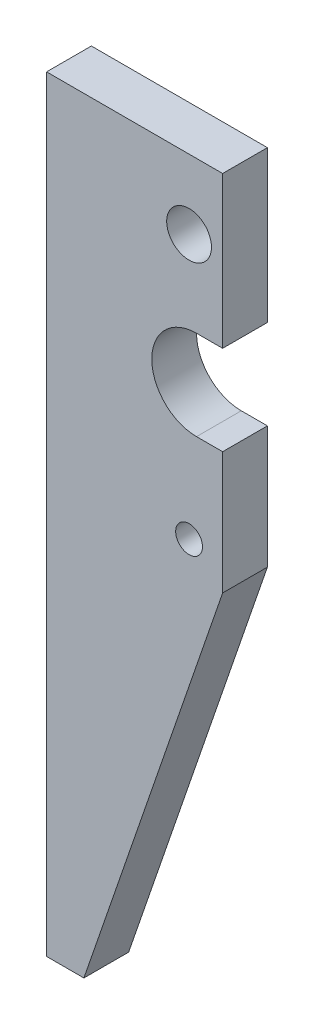
ISO-10303-21;
HEADER;
FILE_DESCRIPTION(('STEP AP214'),'2;1');
FILE_NAME('part.step','',(''),(''),'','','');
FILE_SCHEMA(('AUTOMOTIVE_DESIGN { 1 0 10303 214 1 1 1 1 }'));
ENDSEC;
DATA;
#1=APPLICATION_CONTEXT('core data for automotive mechanical design processes');
#2=APPLICATION_PROTOCOL_DEFINITION('international standard','automotive_design',2000,#1);
#3=PRODUCT_CONTEXT('',#1,'mechanical');
#4=PRODUCT('Part','Part','',(#3));
#5=PRODUCT_RELATED_PRODUCT_CATEGORY('part','',(#4));
#6=PRODUCT_DEFINITION_FORMATION('','',#4);
#7=PRODUCT_DEFINITION_CONTEXT('part definition',#1,'design');
#8=PRODUCT_DEFINITION('design','',#6,#7);
#9=PRODUCT_DEFINITION_SHAPE('','',#8);
#10=(LENGTH_UNIT() NAMED_UNIT(*) SI_UNIT(.MILLI.,.METRE.));
#11=(NAMED_UNIT(*) PLANE_ANGLE_UNIT() SI_UNIT($,.RADIAN.));
#12=(NAMED_UNIT(*) SI_UNIT($,.STERADIAN.) SOLID_ANGLE_UNIT());
#13=UNCERTAINTY_MEASURE_WITH_UNIT(LENGTH_MEASURE(1.E-05),#10,'distance_accuracy_value','');
#14=(GEOMETRIC_REPRESENTATION_CONTEXT(3) GLOBAL_UNCERTAINTY_ASSIGNED_CONTEXT((#13)) GLOBAL_UNIT_ASSIGNED_CONTEXT((#10,
#11,#12)) REPRESENTATION_CONTEXT('',''));
#15=CARTESIAN_POINT('',(0.,0.,0.));
#16=DIRECTION('',(0.,0.,1.));
#17=DIRECTION('',(1.,0.,0.));
#18=AXIS2_PLACEMENT_3D('',#15,#16,#17);
#19=CARTESIAN_POINT('',(53.673673192506,82.0713293790412,6.));
#20=DIRECTION('',(0.,0.,1.));
#21=DIRECTION('',(1.,0.,0.));
#22=AXIS2_PLACEMENT_3D('',#19,#20,#21);
#23=PLANE('',#22);
#24=CARTESIAN_POINT('',(52.6736731925056,63.6713293790409,6.));
#25=DIRECTION('',(0.,0.,1.));
#26=DIRECTION('',(1.,0.,0.));
#27=AXIS2_PLACEMENT_3D('',#24,#25,#26);
#28=CIRCLE('',#27,1.80000000000021);
#29=CARTESIAN_POINT('',(54.4736731925058,63.6713293790409,6.));
#30=VERTEX_POINT('',#29);
#31=EDGE_CURVE('E145',#30,#30,#28,.T.);
#32=ORIENTED_EDGE('',*,*,#31,.F.);
#33=EDGE_LOOP('',(#32));
#34=FACE_BOUND('',#33,.T.);
#35=CARTESIAN_POINT('',(53.673673192506,82.0713293790412,6.));
#36=DIRECTION('',(0.,0.,-1.));
#37=DIRECTION('',(1.,0.,0.));
#38=AXIS2_PLACEMENT_3D('',#35,#36,#37);
#39=CIRCLE('',#38,6.0000000000002);
#40=CARTESIAN_POINT('',(53.673673192506,76.071329379041,6.));
#41=VERTEX_POINT('',#40);
#42=CARTESIAN_POINT('',(53.6736731925061,88.0713293790414,6.));
#43=VERTEX_POINT('',#42);
#44=EDGE_CURVE('E158',#41,#43,#39,.T.);
#45=ORIENTED_EDGE('',*,*,#44,.T.);
#46=DIRECTION('',(1.,1.34812795847367E-13,0.));
#47=VECTOR('',#46,1.);
#48=CARTESIAN_POINT('',(53.6736731925061,88.0713293790414,6.));
#49=LINE('',#48,#47);
#50=CARTESIAN_POINT('',(57.1736731925054,88.0713293790419,6.));
#51=VERTEX_POINT('',#50);
#52=EDGE_CURVE('E101',#43,#51,#49,.T.);
#53=ORIENTED_EDGE('',*,*,#52,.T.);
#54=DIRECTION('',(0.,1.,0.));
#55=VECTOR('',#54,1.);
#56=CARTESIAN_POINT('',(57.1736731925057,108.36959926016,6.));
#57=LINE('',#56,#55);
#58=CARTESIAN_POINT('',(57.1736731925057,108.36959926016,6.));
#59=VERTEX_POINT('',#58);
#60=EDGE_CURVE('E176',#51,#59,#57,.T.);
#61=ORIENTED_EDGE('',*,*,#60,.T.);
#62=DIRECTION('',(-1.,0.,0.));
#63=VECTOR('',#62,1.);
#64=CARTESIAN_POINT('',(57.1736731925057,108.36959926016,6.));
#65=LINE('',#64,#63);
#66=CARTESIAN_POINT('',(33.5736731925061,108.369599260161,6.));
#67=VERTEX_POINT('',#66);
#68=EDGE_CURVE('E193',#59,#67,#65,.T.);
#69=ORIENTED_EDGE('',*,*,#68,.T.);
#70=DIRECTION('',(0.,-1.,0.));
#71=VECTOR('',#70,1.);
#72=CARTESIAN_POINT('',(33.5736731925061,108.369599260161,6.));
#73=LINE('',#72,#71);
#74=CARTESIAN_POINT('',(33.5736731925061,5.67132937904107,6.));
#75=VERTEX_POINT('',#74);
#76=EDGE_CURVE('E192',#67,#75,#73,.T.);
#77=ORIENTED_EDGE('',*,*,#76,.T.);
#78=DIRECTION('',(1.,-1.07899800205757E-13,0.));
#79=VECTOR('',#78,1.);
#80=CARTESIAN_POINT('',(33.5736731925061,5.67132937904107,6.));
#81=LINE('',#80,#79);
#82=CARTESIAN_POINT('',(38.5736731925061,5.67132937904053,6.));
#83=VERTEX_POINT('',#82);
#84=EDGE_CURVE('E123',#75,#83,#81,.T.);
#85=ORIENTED_EDGE('',*,*,#84,.T.);
#86=DIRECTION('',(0.325666906351415,0.945484566826714,0.));
#87=VECTOR('',#86,1.);
#88=CARTESIAN_POINT('',(38.5736731925061,5.67132937904053,6.));
#89=LINE('',#88,#87);
#90=CARTESIAN_POINT('',(57.1736731925057,59.6713293790409,6.));
#91=VERTEX_POINT('',#90);
#92=EDGE_CURVE('E117',#83,#91,#89,.T.);
#93=ORIENTED_EDGE('',*,*,#92,.T.);
#94=DIRECTION('',(0.,1.,0.));
#95=VECTOR('',#94,1.);
#96=CARTESIAN_POINT('',(57.173673192505,76.0713293790407,6.));
#97=LINE('',#96,#95);
#98=CARTESIAN_POINT('',(57.173673192505,76.0713293790407,6.));
#99=VERTEX_POINT('',#98);
#100=EDGE_CURVE('E121',#91,#99,#97,.T.);
#101=ORIENTED_EDGE('',*,*,#100,.T.);
#102=DIRECTION('',(-1.,1.03092138000934E-13,0.));
#103=VECTOR('',#102,1.);
#104=CARTESIAN_POINT('',(53.673673192506,76.071329379041,6.));
#105=LINE('',#104,#103);
#106=EDGE_CURVE('E55',#99,#41,#105,.T.);
#107=ORIENTED_EDGE('',*,*,#106,.T.);
#108=EDGE_LOOP('',(#45,#53,#61,#69,#77,#85,#93,#101,#107));
#109=FACE_BOUND('',#108,.T.);
#110=CARTESIAN_POINT('',(52.6736731925056,99.0589307778287,6.));
#111=DIRECTION('',(0.,0.,1.));
#112=DIRECTION('',(1.,0.,0.));
#113=AXIS2_PLACEMENT_3D('',#110,#111,#112);
#114=CIRCLE('',#113,3.);
#115=CARTESIAN_POINT('',(55.6736731925056,99.0589307778287,6.));
#116=VERTEX_POINT('',#115);
#117=EDGE_CURVE('E203',#116,#116,#114,.T.);
#118=ORIENTED_EDGE('',*,*,#117,.F.);
#119=EDGE_LOOP('',(#118));
#120=FACE_BOUND('',#119,.T.);
#121=ADVANCED_FACE('F38',(#34,#109,#120),#23,.T.);
#122=CARTESIAN_POINT('',(53.673673192506,82.0713293790412,0.));
#123=DIRECTION('',(0.,0.,1.));
#124=DIRECTION('',(1.,0.,0.));
#125=AXIS2_PLACEMENT_3D('',#122,#123,#124);
#126=PLANE('',#125);
#127=CARTESIAN_POINT('',(53.673673192506,82.0713293790412,0.));
#128=DIRECTION('',(0.,0.,-1.));
#129=DIRECTION('',(1.,0.,0.));
#130=AXIS2_PLACEMENT_3D('',#127,#128,#129);
#131=CIRCLE('',#130,6.0000000000002);
#132=CARTESIAN_POINT('',(53.673673192506,76.071329379041,0.));
#133=VERTEX_POINT('',#132);
#134=CARTESIAN_POINT('',(53.6736731925061,88.0713293790414,0.));
#135=VERTEX_POINT('',#134);
#136=EDGE_CURVE('E141',#133,#135,#131,.T.);
#137=ORIENTED_EDGE('',*,*,#136,.F.);
#138=DIRECTION('',(-1.,1.03092138000934E-13,0.));
#139=VECTOR('',#138,1.);
#140=CARTESIAN_POINT('',(53.673673192506,76.071329379041,0.));
#141=LINE('',#140,#139);
#142=CARTESIAN_POINT('',(57.173673192505,76.0713293790407,0.));
#143=VERTEX_POINT('',#142);
#144=EDGE_CURVE('E93',#143,#133,#141,.T.);
#145=ORIENTED_EDGE('',*,*,#144,.F.);
#146=DIRECTION('',(0.,1.,0.));
#147=VECTOR('',#146,1.);
#148=CARTESIAN_POINT('',(57.173673192505,76.0713293790407,0.));
#149=LINE('',#148,#147);
#150=CARTESIAN_POINT('',(57.1736731925057,59.6713293790409,0.));
#151=VERTEX_POINT('',#150);
#152=EDGE_CURVE('E87',#151,#143,#149,.T.);
#153=ORIENTED_EDGE('',*,*,#152,.F.);
#154=DIRECTION('',(0.325666906351415,0.945484566826714,0.));
#155=VECTOR('',#154,1.);
#156=CARTESIAN_POINT('',(38.5736731925061,5.67132937904053,0.));
#157=LINE('',#156,#155);
#158=CARTESIAN_POINT('',(38.5736731925061,5.67132937904053,0.));
#159=VERTEX_POINT('',#158);
#160=EDGE_CURVE('E131',#159,#151,#157,.T.);
#161=ORIENTED_EDGE('',*,*,#160,.F.);
#162=DIRECTION('',(1.,-1.07899800205757E-13,0.));
#163=VECTOR('',#162,1.);
#164=CARTESIAN_POINT('',(33.5736731925061,5.67132937904107,0.));
#165=LINE('',#164,#163);
#166=CARTESIAN_POINT('',(33.5736731925061,5.67132937904107,0.));
#167=VERTEX_POINT('',#166);
#168=EDGE_CURVE('E153',#167,#159,#165,.T.);
#169=ORIENTED_EDGE('',*,*,#168,.F.);
#170=DIRECTION('',(0.,-1.,0.));
#171=VECTOR('',#170,1.);
#172=CARTESIAN_POINT('',(33.5736731925061,108.369599260161,0.));
#173=LINE('',#172,#171);
#174=CARTESIAN_POINT('',(33.5736731925061,108.369599260161,0.));
#175=VERTEX_POINT('',#174);
#176=EDGE_CURVE('E151',#175,#167,#173,.T.);
#177=ORIENTED_EDGE('',*,*,#176,.F.);
#178=DIRECTION('',(-1.,0.,0.));
#179=VECTOR('',#178,1.);
#180=CARTESIAN_POINT('',(57.1736731925057,108.36959926016,0.));
#181=LINE('',#180,#179);
#182=CARTESIAN_POINT('',(57.1736731925057,108.36959926016,0.));
#183=VERTEX_POINT('',#182);
#184=EDGE_CURVE('E149',#183,#175,#181,.T.);
#185=ORIENTED_EDGE('',*,*,#184,.F.);
#186=DIRECTION('',(0.,1.,0.));
#187=VECTOR('',#186,1.);
#188=CARTESIAN_POINT('',(57.1736731925057,108.36959926016,0.));
#189=LINE('',#188,#187);
#190=CARTESIAN_POINT('',(57.1736731925054,88.0713293790419,0.));
#191=VERTEX_POINT('',#190);
#192=EDGE_CURVE('E147',#191,#183,#189,.T.);
#193=ORIENTED_EDGE('',*,*,#192,.F.);
#194=DIRECTION('',(1.,1.34812795847367E-13,0.));
#195=VECTOR('',#194,1.);
#196=CARTESIAN_POINT('',(53.6736731925061,88.0713293790414,0.));
#197=LINE('',#196,#195);
#198=EDGE_CURVE('E144',#135,#191,#197,.T.);
#199=ORIENTED_EDGE('',*,*,#198,.F.);
#200=EDGE_LOOP('',(#137,#145,#153,#161,#169,#177,#185,#193,#199));
#201=FACE_BOUND('',#200,.T.);
#202=CARTESIAN_POINT('',(52.6736731925056,63.6713293790409,0.));
#203=DIRECTION('',(0.,0.,1.));
#204=DIRECTION('',(1.,0.,0.));
#205=AXIS2_PLACEMENT_3D('',#202,#203,#204);
#206=CIRCLE('',#205,1.80000000000021);
#207=CARTESIAN_POINT('',(54.4736731925058,63.6713293790409,0.));
#208=VERTEX_POINT('',#207);
#209=EDGE_CURVE('E200',#208,#208,#206,.T.);
#210=ORIENTED_EDGE('',*,*,#209,.T.);
#211=EDGE_LOOP('',(#210));
#212=FACE_BOUND('',#211,.T.);
#213=CARTESIAN_POINT('',(52.6736731925056,99.0589307778287,0.));
#214=DIRECTION('',(0.,0.,1.));
#215=DIRECTION('',(1.,0.,0.));
#216=AXIS2_PLACEMENT_3D('',#213,#214,#215);
#217=CIRCLE('',#216,3.);
#218=CARTESIAN_POINT('',(55.6736731925056,99.0589307778287,0.));
#219=VERTEX_POINT('',#218);
#220=EDGE_CURVE('E206',#219,#219,#217,.T.);
#221=ORIENTED_EDGE('',*,*,#220,.T.);
#222=EDGE_LOOP('',(#221));
#223=FACE_BOUND('',#222,.T.);
#224=ADVANCED_FACE('F180',(#201,#212,#223),#126,.F.);
#225=CARTESIAN_POINT('',(53.673673192506,82.0713293790412,6.));
#226=DIRECTION('',(0.,0.,-1.));
#227=DIRECTION('',(-1.,0.,0.));
#228=AXIS2_PLACEMENT_3D('',#225,#226,#227);
#229=CYLINDRICAL_SURFACE('',#228,6.0000000000002);
#230=ORIENTED_EDGE('',*,*,#136,.T.);
#231=DIRECTION('',(0.,0.,-1.));
#232=VECTOR('',#231,1.);
#233=CARTESIAN_POINT('',(53.6736731925061,88.0713293790414,6.));
#234=LINE('',#233,#232);
#235=EDGE_CURVE('E11',#43,#135,#234,.T.);
#236=ORIENTED_EDGE('',*,*,#235,.F.);
#237=ORIENTED_EDGE('',*,*,#44,.F.);
#238=DIRECTION('',(0.,0.,-1.));
#239=VECTOR('',#238,1.);
#240=CARTESIAN_POINT('',(53.673673192506,76.071329379041,6.));
#241=LINE('',#240,#239);
#242=EDGE_CURVE('E137',#41,#133,#241,.T.);
#243=ORIENTED_EDGE('',*,*,#242,.T.);
#244=EDGE_LOOP('',(#230,#236,#237,#243));
#245=FACE_BOUND('',#244,.T.);
#246=ADVANCED_FACE('F40',(#245),#229,.F.);
#247=CARTESIAN_POINT('',(53.6736731925061,88.0713293790414,6.));
#248=DIRECTION('',(-1.34812795847367E-13,1.,0.));
#249=DIRECTION('',(-1.,-1.34812795847367E-13,0.));
#250=AXIS2_PLACEMENT_3D('',#247,#248,#249);
#251=PLANE('',#250);
#252=ORIENTED_EDGE('',*,*,#198,.T.);
#253=DIRECTION('',(0.,0.,-1.));
#254=VECTOR('',#253,1.);
#255=CARTESIAN_POINT('',(57.1736731925054,88.0713293790419,6.));
#256=LINE('',#255,#254);
#257=EDGE_CURVE('E47',#51,#191,#256,.T.);
#258=ORIENTED_EDGE('',*,*,#257,.F.);
#259=ORIENTED_EDGE('',*,*,#52,.F.);
#260=ORIENTED_EDGE('',*,*,#235,.T.);
#261=EDGE_LOOP('',(#252,#258,#259,#260));
#262=FACE_BOUND('',#261,.T.);
#263=ADVANCED_FACE('F241',(#262),#251,.F.);
#264=CARTESIAN_POINT('',(57.1736731925057,108.36959926016,6.));
#265=DIRECTION('',(-1.,0.,0.));
#266=DIRECTION('',(0.,-1.,0.));
#267=AXIS2_PLACEMENT_3D('',#264,#265,#266);
#268=PLANE('',#267);
#269=ORIENTED_EDGE('',*,*,#192,.T.);
#270=DIRECTION('',(0.,0.,-1.));
#271=VECTOR('',#270,1.);
#272=CARTESIAN_POINT('',(57.1736731925057,108.36959926016,6.));
#273=LINE('',#272,#271);
#274=EDGE_CURVE('E168',#59,#183,#273,.T.);
#275=ORIENTED_EDGE('',*,*,#274,.F.);
#276=ORIENTED_EDGE('',*,*,#60,.F.);
#277=ORIENTED_EDGE('',*,*,#257,.T.);
#278=EDGE_LOOP('',(#269,#275,#276,#277));
#279=FACE_BOUND('',#278,.T.);
#280=ADVANCED_FACE('F174',(#279),#268,.F.);
#281=CARTESIAN_POINT('',(57.1736731925057,108.36959926016,6.));
#282=DIRECTION('',(0.,-1.,0.));
#283=DIRECTION('',(1.,0.,0.));
#284=AXIS2_PLACEMENT_3D('',#281,#282,#283);
#285=PLANE('',#284);
#286=ORIENTED_EDGE('',*,*,#184,.T.);
#287=DIRECTION('',(0.,0.,-1.));
#288=VECTOR('',#287,1.);
#289=CARTESIAN_POINT('',(33.5736731925061,108.369599260161,6.));
#290=LINE('',#289,#288);
#291=EDGE_CURVE('E165',#67,#175,#290,.T.);
#292=ORIENTED_EDGE('',*,*,#291,.F.);
#293=ORIENTED_EDGE('',*,*,#68,.F.);
#294=ORIENTED_EDGE('',*,*,#274,.T.);
#295=EDGE_LOOP('',(#286,#292,#293,#294));
#296=FACE_BOUND('',#295,.T.);
#297=ADVANCED_FACE('F186',(#296),#285,.F.);
#298=CARTESIAN_POINT('',(33.5736731925061,108.369599260161,6.));
#299=DIRECTION('',(1.,0.,0.));
#300=DIRECTION('',(0.,0.,-1.));
#301=AXIS2_PLACEMENT_3D('',#298,#299,#300);
#302=PLANE('',#301);
#303=ORIENTED_EDGE('',*,*,#176,.T.);
#304=DIRECTION('',(0.,0.,-1.));
#305=VECTOR('',#304,1.);
#306=CARTESIAN_POINT('',(33.5736731925061,5.67132937904107,6.));
#307=LINE('',#306,#305);
#308=EDGE_CURVE('E162',#75,#167,#307,.T.);
#309=ORIENTED_EDGE('',*,*,#308,.F.);
#310=ORIENTED_EDGE('',*,*,#76,.F.);
#311=ORIENTED_EDGE('',*,*,#291,.T.);
#312=EDGE_LOOP('',(#303,#309,#310,#311));
#313=FACE_BOUND('',#312,.T.);
#314=ADVANCED_FACE('F190',(#313),#302,.F.);
#315=CARTESIAN_POINT('',(33.5736731925061,5.67132937904107,6.));
#316=DIRECTION('',(1.07899800205757E-13,1.,0.));
#317=DIRECTION('',(-1.,1.07899800205757E-13,0.));
#318=AXIS2_PLACEMENT_3D('',#315,#316,#317);
#319=PLANE('',#318);
#320=ORIENTED_EDGE('',*,*,#168,.T.);
#321=DIRECTION('',(0.,0.,-1.));
#322=VECTOR('',#321,1.);
#323=CARTESIAN_POINT('',(38.5736731925061,5.67132937904053,6.));
#324=LINE('',#323,#322);
#325=EDGE_CURVE('E132',#83,#159,#324,.T.);
#326=ORIENTED_EDGE('',*,*,#325,.F.);
#327=ORIENTED_EDGE('',*,*,#84,.F.);
#328=ORIENTED_EDGE('',*,*,#308,.T.);
#329=EDGE_LOOP('',(#320,#326,#327,#328));
#330=FACE_BOUND('',#329,.T.);
#331=ADVANCED_FACE('F232',(#330),#319,.F.);
#332=CARTESIAN_POINT('',(38.5736731925061,5.67132937904053,6.));
#333=DIRECTION('',(-0.945484566826714,0.325666906351415,0.));
#334=DIRECTION('',(-0.325666906351415,-0.945484566826714,0.));
#335=AXIS2_PLACEMENT_3D('',#332,#333,#334);
#336=PLANE('',#335);
#337=ORIENTED_EDGE('',*,*,#160,.T.);
#338=DIRECTION('',(0.,0.,-1.));
#339=VECTOR('',#338,1.);
#340=CARTESIAN_POINT('',(57.1736731925057,59.6713293790409,6.));
#341=LINE('',#340,#339);
#342=EDGE_CURVE('E128',#91,#151,#341,.T.);
#343=ORIENTED_EDGE('',*,*,#342,.F.);
#344=ORIENTED_EDGE('',*,*,#92,.F.);
#345=ORIENTED_EDGE('',*,*,#325,.T.);
#346=EDGE_LOOP('',(#337,#343,#344,#345));
#347=FACE_BOUND('',#346,.T.);
#348=ADVANCED_FACE('F129',(#347),#336,.F.);
#349=CARTESIAN_POINT('',(57.173673192505,76.0713293790407,6.));
#350=DIRECTION('',(-1.,0.,0.));
#351=DIRECTION('',(0.,-1.,0.));
#352=AXIS2_PLACEMENT_3D('',#349,#350,#351);
#353=PLANE('',#352);
#354=ORIENTED_EDGE('',*,*,#152,.T.);
#355=DIRECTION('',(0.,0.,-1.));
#356=VECTOR('',#355,1.);
#357=CARTESIAN_POINT('',(57.173673192505,76.0713293790407,6.));
#358=LINE('',#357,#356);
#359=EDGE_CURVE('E133',#99,#143,#358,.T.);
#360=ORIENTED_EDGE('',*,*,#359,.F.);
#361=ORIENTED_EDGE('',*,*,#100,.F.);
#362=ORIENTED_EDGE('',*,*,#342,.T.);
#363=EDGE_LOOP('',(#354,#360,#361,#362));
#364=FACE_BOUND('',#363,.T.);
#365=ADVANCED_FACE('F135',(#364),#353,.F.);
#366=CARTESIAN_POINT('',(53.673673192506,76.071329379041,6.));
#367=DIRECTION('',(-1.03092138000934E-13,-1.,0.));
#368=DIRECTION('',(1.,-1.03092138000934E-13,0.));
#369=AXIS2_PLACEMENT_3D('',#366,#367,#368);
#370=PLANE('',#369);
#371=ORIENTED_EDGE('',*,*,#144,.T.);
#372=ORIENTED_EDGE('',*,*,#242,.F.);
#373=ORIENTED_EDGE('',*,*,#106,.F.);
#374=ORIENTED_EDGE('',*,*,#359,.T.);
#375=EDGE_LOOP('',(#371,#372,#373,#374));
#376=FACE_BOUND('',#375,.T.);
#377=ADVANCED_FACE('F225',(#376),#370,.F.);
#378=CARTESIAN_POINT('',(52.6736731925056,63.6713293790409,6.));
#379=DIRECTION('',(0.,0.,-1.));
#380=DIRECTION('',(-1.,0.,0.));
#381=AXIS2_PLACEMENT_3D('',#378,#379,#380);
#382=CYLINDRICAL_SURFACE('',#381,1.80000000000021);
#383=ORIENTED_EDGE('',*,*,#31,.T.);
#384=EDGE_LOOP('',(#383));
#385=FACE_BOUND('',#384,.T.);
#386=ORIENTED_EDGE('',*,*,#209,.F.);
#387=EDGE_LOOP('',(#386));
#388=FACE_BOUND('',#387,.T.);
#389=ADVANCED_FACE('F222',(#385,#388),#382,.F.);
#390=CARTESIAN_POINT('',(52.6736731925056,99.0589307778287,6.));
#391=DIRECTION('',(0.,0.,-1.));
#392=DIRECTION('',(-1.,0.,0.));
#393=AXIS2_PLACEMENT_3D('',#390,#391,#392);
#394=CYLINDRICAL_SURFACE('',#393,3.);
#395=ORIENTED_EDGE('',*,*,#117,.T.);
#396=EDGE_LOOP('',(#395));
#397=FACE_BOUND('',#396,.T.);
#398=ORIENTED_EDGE('',*,*,#220,.F.);
#399=EDGE_LOOP('',(#398));
#400=FACE_BOUND('',#399,.T.);
#401=ADVANCED_FACE('F212',(#397,#400),#394,.F.);
#402=CLOSED_SHELL('',(#121,#224,#246,#263,#280,#297,#314,#331,#348,#365,#377,#389,#401));
#403=MANIFOLD_SOLID_BREP('B2',#402);
#404=ADVANCED_BREP_SHAPE_REPRESENTATION('',(#18,#403),#14);
#405=SHAPE_DEFINITION_REPRESENTATION(#9,#404);
ENDSEC;
END-ISO-10303-21;
